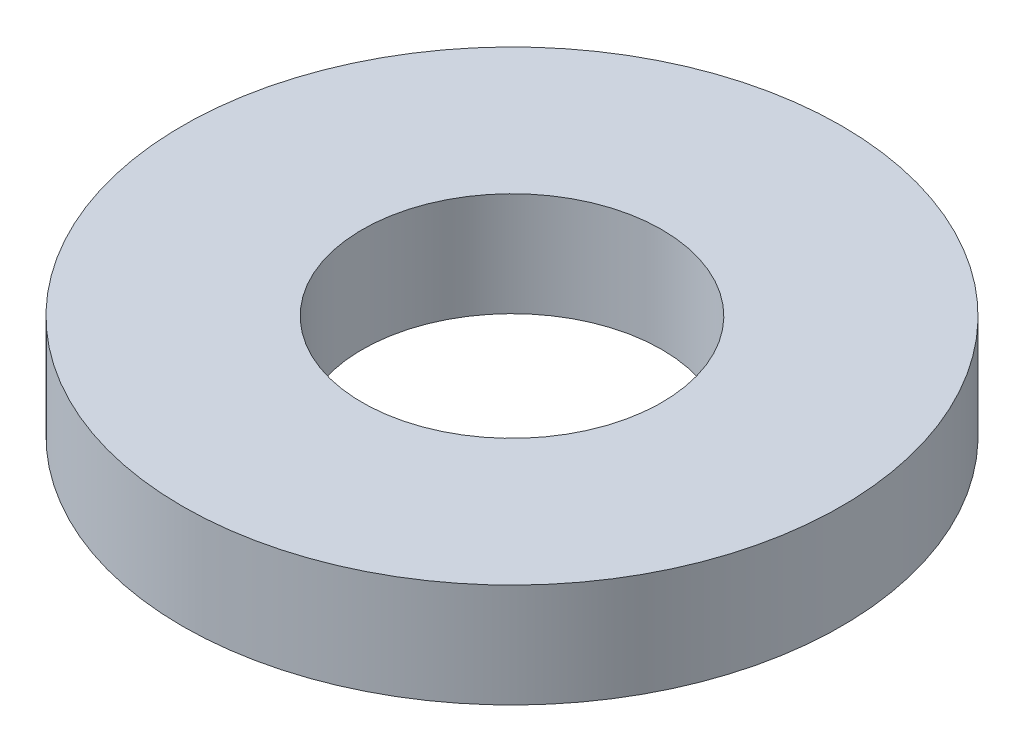
ISO-10303-21;
HEADER;
FILE_DESCRIPTION(('STEP AP214'),'2;1');
FILE_NAME('part.step','',(''),(''),'','','');
FILE_SCHEMA(('AUTOMOTIVE_DESIGN { 1 0 10303 214 1 1 1 1 }'));
ENDSEC;
DATA;
#1=APPLICATION_CONTEXT('core data for automotive mechanical design processes');
#2=APPLICATION_PROTOCOL_DEFINITION('international standard','automotive_design',2000,#1);
#3=PRODUCT_CONTEXT('',#1,'mechanical');
#4=PRODUCT('Part','Part','',(#3));
#5=PRODUCT_RELATED_PRODUCT_CATEGORY('part','',(#4));
#6=PRODUCT_DEFINITION_FORMATION('','',#4);
#7=PRODUCT_DEFINITION_CONTEXT('part definition',#1,'design');
#8=PRODUCT_DEFINITION('design','',#6,#7);
#9=PRODUCT_DEFINITION_SHAPE('','',#8);
#10=(LENGTH_UNIT() NAMED_UNIT(*) SI_UNIT(.MILLI.,.METRE.));
#11=(NAMED_UNIT(*) PLANE_ANGLE_UNIT() SI_UNIT($,.RADIAN.));
#12=(NAMED_UNIT(*) SI_UNIT($,.STERADIAN.) SOLID_ANGLE_UNIT());
#13=UNCERTAINTY_MEASURE_WITH_UNIT(LENGTH_MEASURE(1.E-05),#10,'distance_accuracy_value','');
#14=(GEOMETRIC_REPRESENTATION_CONTEXT(3) GLOBAL_UNCERTAINTY_ASSIGNED_CONTEXT((#13)) GLOBAL_UNIT_ASSIGNED_CONTEXT((#10,
#11,#12)) REPRESENTATION_CONTEXT('',''));
#15=CARTESIAN_POINT('',(0.,0.,0.));
#16=DIRECTION('',(0.,0.,1.));
#17=DIRECTION('',(1.,0.,0.));
#18=AXIS2_PLACEMENT_3D('',#15,#16,#17);
#19=CARTESIAN_POINT('',(0.,26.,0.));
#20=DIRECTION('',(0.,-1.,0.));
#21=DIRECTION('',(0.,0.,-1.));
#22=AXIS2_PLACEMENT_3D('',#19,#20,#21);
#23=CYLINDRICAL_SURFACE('',#22,82.5);
#24=CARTESIAN_POINT('',(0.,26.,0.));
#25=DIRECTION('',(0.,1.,0.));
#26=DIRECTION('',(0.,0.,1.));
#27=AXIS2_PLACEMENT_3D('',#24,#25,#26);
#28=CIRCLE('',#27,82.5);
#29=CARTESIAN_POINT('',(0.,26.,-82.5));
#30=VERTEX_POINT('',#29);
#31=EDGE_CURVE('E10',#30,#30,#28,.T.);
#32=CARTESIAN_POINT('',(0.,0.,0.));
#33=DIRECTION('',(0.,1.,0.));
#34=DIRECTION('',(0.,0.,1.));
#35=AXIS2_PLACEMENT_3D('',#32,#33,#34);
#36=CIRCLE('',#35,82.5);
#37=CARTESIAN_POINT('',(0.,0.,-82.5));
#38=VERTEX_POINT('',#37);
#39=EDGE_CURVE('E37',#38,#38,#36,.T.);
#40=CARTESIAN_POINT('',(0.,26.,-82.5));
#41=CARTESIAN_POINT('',(0.,25.7291666666667,-82.5));
#42=CARTESIAN_POINT('',(0.,25.4583333333333,-82.5));
#43=CARTESIAN_POINT('',(0.,24.9166666666667,-82.5));
#44=CARTESIAN_POINT('',(0.,24.6458333333333,-82.5));
#45=CARTESIAN_POINT('',(0.,24.1041666666667,-82.5));
#46=CARTESIAN_POINT('',(0.,23.8333333333333,-82.5));
#47=CARTESIAN_POINT('',(0.,23.2916666666667,-82.5));
#48=CARTESIAN_POINT('',(0.,23.0208333333333,-82.5));
#49=CARTESIAN_POINT('',(0.,22.4791666666667,-82.5));
#50=CARTESIAN_POINT('',(0.,22.2083333333333,-82.5));
#51=CARTESIAN_POINT('',(0.,21.6666666666667,-82.5));
#52=CARTESIAN_POINT('',(0.,21.3958333333333,-82.5));
#53=CARTESIAN_POINT('',(0.,20.8541666666667,-82.5));
#54=CARTESIAN_POINT('',(0.,20.5833333333333,-82.5));
#55=CARTESIAN_POINT('',(0.,20.0416666666667,-82.5));
#56=CARTESIAN_POINT('',(0.,19.7708333333333,-82.5));
#57=CARTESIAN_POINT('',(0.,19.2291666666667,-82.5));
#58=CARTESIAN_POINT('',(0.,18.9583333333333,-82.5));
#59=CARTESIAN_POINT('',(0.,18.4166666666667,-82.5));
#60=CARTESIAN_POINT('',(0.,18.1458333333333,-82.5));
#61=CARTESIAN_POINT('',(0.,17.6041666666667,-82.5));
#62=CARTESIAN_POINT('',(0.,17.3333333333333,-82.5));
#63=CARTESIAN_POINT('',(0.,16.7916666666667,-82.5));
#64=CARTESIAN_POINT('',(0.,16.5208333333333,-82.5));
#65=CARTESIAN_POINT('',(0.,15.9791666666667,-82.5));
#66=CARTESIAN_POINT('',(0.,15.7083333333333,-82.5));
#67=CARTESIAN_POINT('',(0.,15.1666666666667,-82.5));
#68=CARTESIAN_POINT('',(0.,14.8958333333333,-82.5));
#69=CARTESIAN_POINT('',(0.,14.3541666666667,-82.5));
#70=CARTESIAN_POINT('',(0.,14.0833333333333,-82.5));
#71=CARTESIAN_POINT('',(0.,13.5416666666667,-82.5));
#72=CARTESIAN_POINT('',(0.,13.2708333333333,-82.5));
#73=CARTESIAN_POINT('',(0.,12.7291666666667,-82.5));
#74=CARTESIAN_POINT('',(0.,12.4583333333333,-82.5));
#75=CARTESIAN_POINT('',(0.,11.9166666666667,-82.5));
#76=CARTESIAN_POINT('',(0.,11.6458333333333,-82.5));
#77=CARTESIAN_POINT('',(0.,11.1041666666667,-82.5));
#78=CARTESIAN_POINT('',(0.,10.8333333333333,-82.5));
#79=CARTESIAN_POINT('',(0.,10.2916666666667,-82.5));
#80=CARTESIAN_POINT('',(0.,10.0208333333333,-82.5));
#81=CARTESIAN_POINT('',(0.,9.47916666666667,-82.5));
#82=CARTESIAN_POINT('',(0.,9.20833333333333,-82.5));
#83=CARTESIAN_POINT('',(0.,8.66666666666667,-82.5));
#84=CARTESIAN_POINT('',(0.,8.39583333333333,-82.5));
#85=CARTESIAN_POINT('',(0.,7.85416666666667,-82.5));
#86=CARTESIAN_POINT('',(0.,7.58333333333333,-82.5));
#87=CARTESIAN_POINT('',(0.,7.04166666666667,-82.5));
#88=CARTESIAN_POINT('',(0.,6.77083333333333,-82.5));
#89=CARTESIAN_POINT('',(0.,6.22916666666667,-82.5));
#90=CARTESIAN_POINT('',(0.,5.95833333333333,-82.5));
#91=CARTESIAN_POINT('',(0.,5.41666666666667,-82.5));
#92=CARTESIAN_POINT('',(0.,5.14583333333333,-82.5));
#93=CARTESIAN_POINT('',(0.,4.60416666666667,-82.5));
#94=CARTESIAN_POINT('',(0.,4.33333333333333,-82.5));
#95=CARTESIAN_POINT('',(0.,3.79166666666667,-82.5));
#96=CARTESIAN_POINT('',(0.,3.52083333333333,-82.5));
#97=CARTESIAN_POINT('',(0.,2.97916666666667,-82.5));
#98=CARTESIAN_POINT('',(0.,2.70833333333333,-82.5));
#99=CARTESIAN_POINT('',(0.,2.16666666666667,-82.5));
#100=CARTESIAN_POINT('',(0.,1.89583333333333,-82.5));
#101=CARTESIAN_POINT('',(0.,1.35416666666667,-82.5));
#102=CARTESIAN_POINT('',(0.,1.08333333333333,-82.5));
#103=CARTESIAN_POINT('',(0.,0.541666666666667,-82.5));
#104=CARTESIAN_POINT('',(0.,0.270833333333334,-82.5));
#105=CARTESIAN_POINT('',(0.,0.,-82.5));
#106=B_SPLINE_CURVE_WITH_KNOTS('',3,(#40,#41,#42,#43,#44,#45,#46,#47,#48,#49,#50,#51,#52,#53,
#54,#55,#56,#57,#58,#59,#60,#61,#62,#63,#64,#65,#66,#67,#68,#69,#70,#71,#72,#73,#74,#75,#76,#77,
#78,#79,#80,#81,#82,#83,#84,#85,#86,#87,#88,#89,#90,#91,#92,#93,#94,#95,#96,#97,#98,#99,#100,
#101,#102,#103,#104,#105),.UNSPECIFIED.,.F.,.F.,(4,2,2,2,2,2,2,2,2,2,2,2,2,2,2,2,2,2,2,2,2,2,2,
2,2,2,2,2,2,2,2,2,4),(0.,0.812500000000001,1.625,2.4375,3.25,4.0625,4.875,5.6875,6.5,7.3125,
8.125,8.9375,9.75,10.5625,11.375,12.1875,13.,13.8125,14.625,15.4375,16.25,17.0625,17.875,
18.6875,19.5,20.3125,21.125,21.9375,22.75,23.5625,24.375,25.1875,26.),.UNSPECIFIED.);
#107=EDGE_CURVE('BSEAM40',#30,#38,#106,.T.);
#108=ORIENTED_EDGE('',*,*,#31,.F.);
#109=ORIENTED_EDGE('',*,*,#39,.T.);
#110=ORIENTED_EDGE('',*,*,#107,.T.);
#111=ORIENTED_EDGE('',*,*,#107,.F.);
#112=EDGE_LOOP('',(#108,#110,#109,#111));
#113=FACE_BOUND('',#112,.T.);
#114=ADVANCED_FACE('F40',(#113),#23,.T.);
#115=CARTESIAN_POINT('',(0.,26.,0.));
#116=DIRECTION('',(0.,1.,0.));
#117=DIRECTION('',(0.,0.,1.));
#118=AXIS2_PLACEMENT_3D('',#115,#116,#117);
#119=PLANE('',#118);
#120=CARTESIAN_POINT('',(0.,26.,0.));
#121=DIRECTION('',(0.,1.,0.));
#122=DIRECTION('',(0.,0.,1.));
#123=AXIS2_PLACEMENT_3D('',#120,#121,#122);
#124=CIRCLE('',#123,37.5);
#125=CARTESIAN_POINT('',(0.,26.,-37.5));
#126=VERTEX_POINT('',#125);
#127=EDGE_CURVE('E50',#126,#126,#124,.T.);
#128=ORIENTED_EDGE('',*,*,#127,.F.);
#129=EDGE_LOOP('',(#128));
#130=FACE_BOUND('',#129,.T.);
#131=ORIENTED_EDGE('',*,*,#31,.T.);
#132=EDGE_LOOP('',(#131));
#133=FACE_BOUND('',#132,.T.);
#134=ADVANCED_FACE('F59',(#130,#133),#119,.T.);
#135=CARTESIAN_POINT('',(0.,0.,0.));
#136=DIRECTION('',(0.,1.,0.));
#137=DIRECTION('',(0.,0.,1.));
#138=AXIS2_PLACEMENT_3D('',#135,#136,#137);
#139=PLANE('',#138);
#140=CARTESIAN_POINT('',(0.,0.,0.));
#141=DIRECTION('',(0.,1.,0.));
#142=DIRECTION('',(0.,0.,1.));
#143=AXIS2_PLACEMENT_3D('',#140,#141,#142);
#144=CIRCLE('',#143,37.5);
#145=CARTESIAN_POINT('',(0.,0.,-37.5));
#146=VERTEX_POINT('',#145);
#147=EDGE_CURVE('E47',#146,#146,#144,.T.);
#148=ORIENTED_EDGE('',*,*,#147,.T.);
#149=EDGE_LOOP('',(#148));
#150=FACE_BOUND('',#149,.T.);
#151=ORIENTED_EDGE('',*,*,#39,.F.);
#152=EDGE_LOOP('',(#151));
#153=FACE_BOUND('',#152,.T.);
#154=ADVANCED_FACE('F58',(#150,#153),#139,.F.);
#155=CARTESIAN_POINT('',(0.,26.,0.));
#156=DIRECTION('',(0.,-1.,0.));
#157=DIRECTION('',(0.,0.,-1.));
#158=AXIS2_PLACEMENT_3D('',#155,#156,#157);
#159=CYLINDRICAL_SURFACE('',#158,37.5);
#160=CARTESIAN_POINT('',(0.,26.,-37.5));
#161=CARTESIAN_POINT('',(0.,25.7291666666667,-37.5));
#162=CARTESIAN_POINT('',(0.,25.4583333333333,-37.5));
#163=CARTESIAN_POINT('',(0.,24.9166666666667,-37.5));
#164=CARTESIAN_POINT('',(0.,24.6458333333333,-37.5));
#165=CARTESIAN_POINT('',(0.,24.1041666666667,-37.5));
#166=CARTESIAN_POINT('',(0.,23.8333333333333,-37.5));
#167=CARTESIAN_POINT('',(0.,23.2916666666667,-37.5));
#168=CARTESIAN_POINT('',(0.,23.0208333333333,-37.5));
#169=CARTESIAN_POINT('',(0.,22.4791666666667,-37.5));
#170=CARTESIAN_POINT('',(0.,22.2083333333333,-37.5));
#171=CARTESIAN_POINT('',(0.,21.6666666666667,-37.5));
#172=CARTESIAN_POINT('',(0.,21.3958333333333,-37.5));
#173=CARTESIAN_POINT('',(0.,20.8541666666667,-37.5));
#174=CARTESIAN_POINT('',(0.,20.5833333333333,-37.5));
#175=CARTESIAN_POINT('',(0.,20.0416666666667,-37.5));
#176=CARTESIAN_POINT('',(0.,19.7708333333333,-37.5));
#177=CARTESIAN_POINT('',(0.,19.2291666666667,-37.5));
#178=CARTESIAN_POINT('',(0.,18.9583333333333,-37.5));
#179=CARTESIAN_POINT('',(0.,18.4166666666667,-37.5));
#180=CARTESIAN_POINT('',(0.,18.1458333333333,-37.5));
#181=CARTESIAN_POINT('',(0.,17.6041666666667,-37.5));
#182=CARTESIAN_POINT('',(0.,17.3333333333333,-37.5));
#183=CARTESIAN_POINT('',(0.,16.7916666666667,-37.5));
#184=CARTESIAN_POINT('',(0.,16.5208333333333,-37.5));
#185=CARTESIAN_POINT('',(0.,15.9791666666667,-37.5));
#186=CARTESIAN_POINT('',(0.,15.7083333333333,-37.5));
#187=CARTESIAN_POINT('',(0.,15.1666666666667,-37.5));
#188=CARTESIAN_POINT('',(0.,14.8958333333333,-37.5));
#189=CARTESIAN_POINT('',(0.,14.3541666666667,-37.5));
#190=CARTESIAN_POINT('',(0.,14.0833333333333,-37.5));
#191=CARTESIAN_POINT('',(0.,13.5416666666667,-37.5));
#192=CARTESIAN_POINT('',(0.,13.2708333333333,-37.5));
#193=CARTESIAN_POINT('',(0.,12.7291666666667,-37.5));
#194=CARTESIAN_POINT('',(0.,12.4583333333333,-37.5));
#195=CARTESIAN_POINT('',(0.,11.9166666666667,-37.5));
#196=CARTESIAN_POINT('',(0.,11.6458333333333,-37.5));
#197=CARTESIAN_POINT('',(0.,11.1041666666667,-37.5));
#198=CARTESIAN_POINT('',(0.,10.8333333333333,-37.5));
#199=CARTESIAN_POINT('',(0.,10.2916666666667,-37.5));
#200=CARTESIAN_POINT('',(0.,10.0208333333333,-37.5));
#201=CARTESIAN_POINT('',(0.,9.47916666666667,-37.5));
#202=CARTESIAN_POINT('',(0.,9.20833333333333,-37.5));
#203=CARTESIAN_POINT('',(0.,8.66666666666667,-37.5));
#204=CARTESIAN_POINT('',(0.,8.39583333333333,-37.5));
#205=CARTESIAN_POINT('',(0.,7.85416666666667,-37.5));
#206=CARTESIAN_POINT('',(0.,7.58333333333333,-37.5));
#207=CARTESIAN_POINT('',(0.,7.04166666666667,-37.5));
#208=CARTESIAN_POINT('',(0.,6.77083333333333,-37.5));
#209=CARTESIAN_POINT('',(0.,6.22916666666667,-37.5));
#210=CARTESIAN_POINT('',(0.,5.95833333333333,-37.5));
#211=CARTESIAN_POINT('',(0.,5.41666666666667,-37.5));
#212=CARTESIAN_POINT('',(0.,5.14583333333333,-37.5));
#213=CARTESIAN_POINT('',(0.,4.60416666666667,-37.5));
#214=CARTESIAN_POINT('',(0.,4.33333333333333,-37.5));
#215=CARTESIAN_POINT('',(0.,3.79166666666667,-37.5));
#216=CARTESIAN_POINT('',(0.,3.52083333333333,-37.5));
#217=CARTESIAN_POINT('',(0.,2.97916666666667,-37.5));
#218=CARTESIAN_POINT('',(0.,2.70833333333333,-37.5));
#219=CARTESIAN_POINT('',(0.,2.16666666666667,-37.5));
#220=CARTESIAN_POINT('',(0.,1.89583333333333,-37.5));
#221=CARTESIAN_POINT('',(0.,1.35416666666667,-37.5));
#222=CARTESIAN_POINT('',(0.,1.08333333333333,-37.5));
#223=CARTESIAN_POINT('',(0.,0.541666666666667,-37.5));
#224=CARTESIAN_POINT('',(0.,0.270833333333334,-37.5));
#225=CARTESIAN_POINT('',(0.,0.,-37.5));
#226=B_SPLINE_CURVE_WITH_KNOTS('',3,(#160,#161,#162,#163,#164,#165,#166,#167,#168,#169,#170,
#171,#172,#173,#174,#175,#176,#177,#178,#179,#180,#181,#182,#183,#184,#185,#186,#187,#188,#189,
#190,#191,#192,#193,#194,#195,#196,#197,#198,#199,#200,#201,#202,#203,#204,#205,#206,#207,#208,
#209,#210,#211,#212,#213,#214,#215,#216,#217,#218,#219,#220,#221,#222,#223,#224,#225),
.UNSPECIFIED.,.F.,.F.,(4,2,2,2,2,2,2,2,2,2,2,2,2,2,2,2,2,2,2,2,2,2,2,2,2,2,2,2,2,2,2,2,4),(0.,
0.812499999999997,1.625,2.4375,3.25,4.0625,4.875,5.6875,6.5,7.3125,8.125,8.93749999999999,
9.74999999999999,10.5625,11.375,12.1875,13.,13.8125,14.625,15.4375,16.25,17.0625,17.875,18.6875,
19.5,20.3125,21.125,21.9375,22.75,23.5625,24.375,25.1875,26.),.UNSPECIFIED.);
#227=EDGE_CURVE('BSEAM54',#126,#146,#226,.T.);
#228=ORIENTED_EDGE('',*,*,#127,.T.);
#229=ORIENTED_EDGE('',*,*,#147,.F.);
#230=ORIENTED_EDGE('',*,*,#227,.T.);
#231=ORIENTED_EDGE('',*,*,#227,.F.);
#232=EDGE_LOOP('',(#228,#230,#229,#231));
#233=FACE_BOUND('',#232,.T.);
#234=ADVANCED_FACE('F54',(#233),#159,.F.);
#235=CLOSED_SHELL('',(#114,#134,#154,#234));
#236=MANIFOLD_SOLID_BREP('B2',#235);
#237=ADVANCED_BREP_SHAPE_REPRESENTATION('',(#18,#236),#14);
#238=SHAPE_DEFINITION_REPRESENTATION(#9,#237);
ENDSEC;
END-ISO-10303-21;
